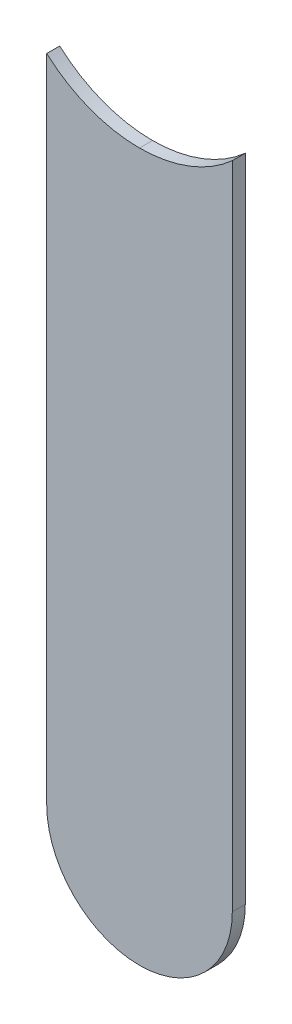
ISO-10303-21;
HEADER;
FILE_DESCRIPTION(('STEP AP214'),'2;1');
FILE_NAME('part.step','',(''),(''),'','','');
FILE_SCHEMA(('AUTOMOTIVE_DESIGN { 1 0 10303 214 1 1 1 1 }'));
ENDSEC;
DATA;
#1=APPLICATION_CONTEXT('core data for automotive mechanical design processes');
#2=APPLICATION_PROTOCOL_DEFINITION('international standard','automotive_design',2000,#1);
#3=PRODUCT_CONTEXT('',#1,'mechanical');
#4=PRODUCT('Part','Part','',(#3));
#5=PRODUCT_RELATED_PRODUCT_CATEGORY('part','',(#4));
#6=PRODUCT_DEFINITION_FORMATION('','',#4);
#7=PRODUCT_DEFINITION_CONTEXT('part definition',#1,'design');
#8=PRODUCT_DEFINITION('design','',#6,#7);
#9=PRODUCT_DEFINITION_SHAPE('','',#8);
#10=(LENGTH_UNIT() NAMED_UNIT(*) SI_UNIT(.MILLI.,.METRE.));
#11=(NAMED_UNIT(*) PLANE_ANGLE_UNIT() SI_UNIT($,.RADIAN.));
#12=(NAMED_UNIT(*) SI_UNIT($,.STERADIAN.) SOLID_ANGLE_UNIT());
#13=UNCERTAINTY_MEASURE_WITH_UNIT(LENGTH_MEASURE(1.E-05),#10,'distance_accuracy_value','');
#14=(GEOMETRIC_REPRESENTATION_CONTEXT(3) GLOBAL_UNCERTAINTY_ASSIGNED_CONTEXT((#13)) GLOBAL_UNIT_ASSIGNED_CONTEXT((#10,
#11,#12)) REPRESENTATION_CONTEXT('',''));
#15=CARTESIAN_POINT('',(0.,0.,0.));
#16=DIRECTION('',(0.,0.,1.));
#17=DIRECTION('',(1.,0.,0.));
#18=AXIS2_PLACEMENT_3D('',#15,#16,#17);
#19=CARTESIAN_POINT('',(157.48,-80.772,-0.045));
#20=DIRECTION('',(0.,0.,-1.));
#21=DIRECTION('',(0.,-1.,0.));
#22=AXIS2_PLACEMENT_3D('',#19,#20,#21);
#23=CYLINDRICAL_SURFACE('',#22,0.375);
#24=DIRECTION('',(0.,0.,1.));
#25=VECTOR('',#24,1.);
#26=CARTESIAN_POINT('',(157.48,-81.147,-0.045));
#27=LINE('',#26,#25);
#28=CARTESIAN_POINT('',(157.48,-81.147,-0.035));
#29=VERTEX_POINT('',#28);
#30=CARTESIAN_POINT('',(157.48,-81.147,0.));
#31=VERTEX_POINT('',#30);
#32=EDGE_CURVE('E70',#29,#31,#27,.T.);
#33=ORIENTED_EDGE('',*,*,#32,.F.);
#34=CARTESIAN_POINT('',(157.48,-80.772,-0.035));
#35=DIRECTION('',(0.,0.,-1.));
#36=DIRECTION('',(0.,-1.,0.));
#37=AXIS2_PLACEMENT_3D('',#34,#35,#36);
#38=CIRCLE('',#37,0.375);
#39=CARTESIAN_POINT('',(157.23,-81.05150849717,-0.035));
#40=VERTEX_POINT('',#39);
#41=EDGE_CURVE('E141',#29,#40,#38,.T.);
#42=ORIENTED_EDGE('',*,*,#41,.T.);
#43=DIRECTION('',(0.,0.,-1.));
#44=VECTOR('',#43,1.);
#45=CARTESIAN_POINT('',(157.23,-81.05150849718,-0.045));
#46=LINE('',#45,#44);
#47=CARTESIAN_POINT('',(157.23,-81.05150849717,0.));
#48=VERTEX_POINT('',#47);
#49=EDGE_CURVE('E11',#48,#40,#46,.T.);
#50=ORIENTED_EDGE('',*,*,#49,.F.);
#51=CARTESIAN_POINT('',(157.48,-80.772,0.));
#52=DIRECTION('',(0.,0.,-1.));
#53=DIRECTION('',(0.,-1.,0.));
#54=AXIS2_PLACEMENT_3D('',#51,#52,#53);
#55=CIRCLE('',#54,0.375);
#56=EDGE_CURVE('E75',#31,#48,#55,.T.);
#57=ORIENTED_EDGE('',*,*,#56,.F.);
#58=EDGE_LOOP('',(#33,#42,#50,#57));
#59=FACE_BOUND('',#58,.T.);
#60=ADVANCED_FACE('F17',(#59),#23,.F.);
#61=CARTESIAN_POINT('',(157.23,-80.772,-0.035));
#62=DIRECTION('',(1.,0.,0.));
#63=DIRECTION('',(0.,1.,0.));
#64=AXIS2_PLACEMENT_3D('',#61,#62,#63);
#65=PLANE('',#64);
#66=DIRECTION('',(0.,0.,1.));
#67=VECTOR('',#66,1.);
#68=CARTESIAN_POINT('',(157.23,-82.804,-0.035));
#69=LINE('',#68,#67);
#70=CARTESIAN_POINT('',(157.23,-82.804,-0.035));
#71=VERTEX_POINT('',#70);
#72=CARTESIAN_POINT('',(157.23,-82.804,0.));
#73=VERTEX_POINT('',#72);
#74=EDGE_CURVE('E26',#71,#73,#69,.T.);
#75=ORIENTED_EDGE('',*,*,#74,.T.);
#76=DIRECTION('',(0.,-1.,0.));
#77=VECTOR('',#76,1.);
#78=CARTESIAN_POINT('',(157.23,-80.772,0.));
#79=LINE('',#78,#77);
#80=EDGE_CURVE('E80',#48,#73,#79,.T.);
#81=ORIENTED_EDGE('',*,*,#80,.F.);
#82=ORIENTED_EDGE('',*,*,#49,.T.);
#83=DIRECTION('',(0.,-1.,0.));
#84=VECTOR('',#83,1.);
#85=CARTESIAN_POINT('',(157.23,-80.772,-0.035));
#86=LINE('',#85,#84);
#87=EDGE_CURVE('E116',#40,#71,#86,.T.);
#88=ORIENTED_EDGE('',*,*,#87,.T.);
#89=EDGE_LOOP('',(#75,#81,#82,#88));
#90=FACE_BOUND('',#89,.T.);
#91=ADVANCED_FACE('F114',(#90),#65,.F.);
#92=CARTESIAN_POINT('',(157.48,-82.804,-0.035));
#93=DIRECTION('',(0.,0.,-1.));
#94=DIRECTION('',(-1.,0.,0.));
#95=AXIS2_PLACEMENT_3D('',#92,#93,#94);
#96=CYLINDRICAL_SURFACE('',#95,0.25);
#97=CARTESIAN_POINT('',(157.48,-82.804,-0.035));
#98=DIRECTION('',(0.,0.,1.));
#99=DIRECTION('',(-1.,0.,0.));
#100=AXIS2_PLACEMENT_3D('',#97,#98,#99);
#101=CIRCLE('',#100,0.25);
#102=CARTESIAN_POINT('',(157.73,-82.804,-0.035));
#103=VERTEX_POINT('',#102);
#104=EDGE_CURVE('E97',#71,#103,#101,.T.);
#105=ORIENTED_EDGE('',*,*,#104,.T.);
#106=DIRECTION('',(0.,0.,1.));
#107=VECTOR('',#106,1.);
#108=CARTESIAN_POINT('',(157.73,-82.804,-0.035));
#109=LINE('',#108,#107);
#110=CARTESIAN_POINT('',(157.73,-82.804,0.));
#111=VERTEX_POINT('',#110);
#112=EDGE_CURVE('E123',#103,#111,#109,.T.);
#113=ORIENTED_EDGE('',*,*,#112,.T.);
#114=CARTESIAN_POINT('',(157.48,-82.804,0.));
#115=DIRECTION('',(0.,0.,1.));
#116=DIRECTION('',(-1.,0.,0.));
#117=AXIS2_PLACEMENT_3D('',#114,#115,#116);
#118=CIRCLE('',#117,0.25);
#119=EDGE_CURVE('E81',#73,#111,#118,.T.);
#120=ORIENTED_EDGE('',*,*,#119,.F.);
#121=ORIENTED_EDGE('',*,*,#74,.F.);
#122=EDGE_LOOP('',(#105,#113,#120,#121));
#123=FACE_BOUND('',#122,.T.);
#124=ADVANCED_FACE('F121',(#123),#96,.T.);
#125=CARTESIAN_POINT('',(157.73,-82.804,0.));
#126=DIRECTION('',(0.,0.,1.));
#127=DIRECTION('',(1.,0.,0.));
#128=AXIS2_PLACEMENT_3D('',#125,#126,#127);
#129=PLANE('',#128);
#130=ORIENTED_EDGE('',*,*,#119,.T.);
#131=DIRECTION('',(0.,1.,0.));
#132=VECTOR('',#131,1.);
#133=CARTESIAN_POINT('',(157.73,-82.804,0.));
#134=LINE('',#133,#132);
#135=CARTESIAN_POINT('',(157.73,-81.05150849717,0.));
#136=VERTEX_POINT('',#135);
#137=EDGE_CURVE('E87',#111,#136,#134,.T.);
#138=ORIENTED_EDGE('',*,*,#137,.T.);
#139=CARTESIAN_POINT('',(157.48,-80.772,0.));
#140=DIRECTION('',(0.,0.,-1.));
#141=DIRECTION('',(0.,-1.,0.));
#142=AXIS2_PLACEMENT_3D('',#139,#140,#141);
#143=CIRCLE('',#142,0.375);
#144=EDGE_CURVE('E84',#136,#31,#143,.T.);
#145=ORIENTED_EDGE('',*,*,#144,.T.);
#146=ORIENTED_EDGE('',*,*,#56,.T.);
#147=ORIENTED_EDGE('',*,*,#80,.T.);
#148=EDGE_LOOP('',(#130,#138,#145,#146,#147));
#149=FACE_BOUND('',#148,.T.);
#150=ADVANCED_FACE('F85',(#149),#129,.T.);
#151=CARTESIAN_POINT('',(157.48,-80.772,-0.045));
#152=DIRECTION('',(0.,0.,-1.));
#153=DIRECTION('',(0.,-1.,0.));
#154=AXIS2_PLACEMENT_3D('',#151,#152,#153);
#155=CYLINDRICAL_SURFACE('',#154,0.375);
#156=CARTESIAN_POINT('',(157.48,-80.772,-0.035));
#157=DIRECTION('',(0.,0.,-1.));
#158=DIRECTION('',(0.,-1.,0.));
#159=AXIS2_PLACEMENT_3D('',#156,#157,#158);
#160=CIRCLE('',#159,0.375);
#161=CARTESIAN_POINT('',(157.73,-81.05150849717,-0.035));
#162=VERTEX_POINT('',#161);
#163=EDGE_CURVE('E94',#162,#29,#160,.T.);
#164=ORIENTED_EDGE('',*,*,#163,.T.);
#165=ORIENTED_EDGE('',*,*,#32,.T.);
#166=ORIENTED_EDGE('',*,*,#144,.F.);
#167=DIRECTION('',(0.,0.,-1.));
#168=VECTOR('',#167,1.);
#169=CARTESIAN_POINT('',(157.73,-81.05150849718,-0.045));
#170=LINE('',#169,#168);
#171=EDGE_CURVE('E131',#136,#162,#170,.T.);
#172=ORIENTED_EDGE('',*,*,#171,.T.);
#173=EDGE_LOOP('',(#164,#165,#166,#172));
#174=FACE_BOUND('',#173,.T.);
#175=ADVANCED_FACE('F93',(#174),#155,.F.);
#176=CARTESIAN_POINT('',(157.73,-82.804,-0.035));
#177=DIRECTION('',(0.,0.,1.));
#178=DIRECTION('',(1.,0.,0.));
#179=AXIS2_PLACEMENT_3D('',#176,#177,#178);
#180=PLANE('',#179);
#181=ORIENTED_EDGE('',*,*,#87,.F.);
#182=ORIENTED_EDGE('',*,*,#41,.F.);
#183=ORIENTED_EDGE('',*,*,#163,.F.);
#184=DIRECTION('',(0.,1.,0.));
#185=VECTOR('',#184,1.);
#186=CARTESIAN_POINT('',(157.73,-82.804,-0.035));
#187=LINE('',#186,#185);
#188=EDGE_CURVE('E128',#103,#162,#187,.T.);
#189=ORIENTED_EDGE('',*,*,#188,.F.);
#190=ORIENTED_EDGE('',*,*,#104,.F.);
#191=EDGE_LOOP('',(#181,#182,#183,#189,#190));
#192=FACE_BOUND('',#191,.T.);
#193=ADVANCED_FACE('F148',(#192),#180,.F.);
#194=CARTESIAN_POINT('',(157.73,-82.804,-0.035));
#195=DIRECTION('',(-1.,0.,0.));
#196=DIRECTION('',(0.,0.,1.));
#197=AXIS2_PLACEMENT_3D('',#194,#195,#196);
#198=PLANE('',#197);
#199=ORIENTED_EDGE('',*,*,#171,.F.);
#200=ORIENTED_EDGE('',*,*,#137,.F.);
#201=ORIENTED_EDGE('',*,*,#112,.F.);
#202=ORIENTED_EDGE('',*,*,#188,.T.);
#203=EDGE_LOOP('',(#199,#200,#201,#202));
#204=FACE_BOUND('',#203,.T.);
#205=ADVANCED_FACE('F130',(#204),#198,.F.);
#206=CLOSED_SHELL('',(#60,#91,#124,#150,#175,#193,#205));
#207=MANIFOLD_SOLID_BREP('B1',#206);
#208=ADVANCED_BREP_SHAPE_REPRESENTATION('',(#18,#207),#14);
#209=SHAPE_DEFINITION_REPRESENTATION(#9,#208);
ENDSEC;
END-ISO-10303-21;
